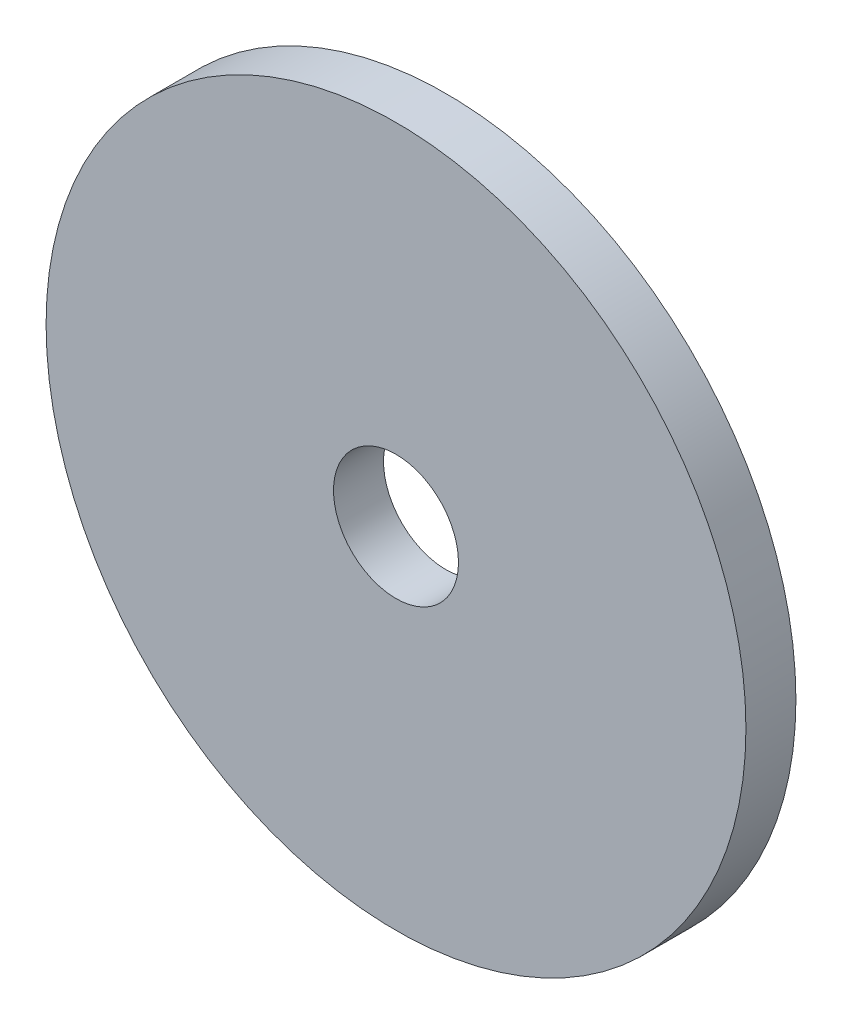
ISO-10303-21;
HEADER;
FILE_DESCRIPTION(('STEP AP214'),'2;1');
FILE_NAME('part.step','',(''),(''),'','','');
FILE_SCHEMA(('AUTOMOTIVE_DESIGN { 1 0 10303 214 1 1 1 1 }'));
ENDSEC;
DATA;
#1=APPLICATION_CONTEXT('core data for automotive mechanical design processes');
#2=APPLICATION_PROTOCOL_DEFINITION('international standard','automotive_design',2000,#1);
#3=PRODUCT_CONTEXT('',#1,'mechanical');
#4=PRODUCT('Part','Part','',(#3));
#5=PRODUCT_RELATED_PRODUCT_CATEGORY('part','',(#4));
#6=PRODUCT_DEFINITION_FORMATION('','',#4);
#7=PRODUCT_DEFINITION_CONTEXT('part definition',#1,'design');
#8=PRODUCT_DEFINITION('design','',#6,#7);
#9=PRODUCT_DEFINITION_SHAPE('','',#8);
#10=(LENGTH_UNIT() NAMED_UNIT(*) SI_UNIT(.MILLI.,.METRE.));
#11=(NAMED_UNIT(*) PLANE_ANGLE_UNIT() SI_UNIT($,.RADIAN.));
#12=(NAMED_UNIT(*) SI_UNIT($,.STERADIAN.) SOLID_ANGLE_UNIT());
#13=UNCERTAINTY_MEASURE_WITH_UNIT(LENGTH_MEASURE(1.E-05),#10,'distance_accuracy_value','');
#14=(GEOMETRIC_REPRESENTATION_CONTEXT(3) GLOBAL_UNCERTAINTY_ASSIGNED_CONTEXT((#13)) GLOBAL_UNIT_ASSIGNED_CONTEXT((#10,
#11,#12)) REPRESENTATION_CONTEXT('',''));
#15=CARTESIAN_POINT('',(0.,0.,0.));
#16=DIRECTION('',(0.,0.,1.));
#17=DIRECTION('',(1.,0.,0.));
#18=AXIS2_PLACEMENT_3D('',#15,#16,#17);
#19=CARTESIAN_POINT('',(0.,0.,2.));
#20=DIRECTION('',(0.,0.,1.));
#21=DIRECTION('',(1.,0.,0.));
#22=AXIS2_PLACEMENT_3D('',#19,#20,#21);
#23=PLANE('',#22);
#24=CARTESIAN_POINT('',(0.,0.,2.));
#25=DIRECTION('',(0.,0.,1.));
#26=DIRECTION('',(1.,0.,0.));
#27=AXIS2_PLACEMENT_3D('',#24,#25,#26);
#28=CIRCLE('',#27,14.);
#29=CARTESIAN_POINT('',(14.,0.,2.));
#30=VERTEX_POINT('',#29);
#31=EDGE_CURVE('E12',#30,#30,#28,.T.);
#32=ORIENTED_EDGE('',*,*,#31,.T.);
#33=EDGE_LOOP('',(#32));
#34=FACE_BOUND('',#33,.T.);
#35=CARTESIAN_POINT('',(0.,0.,2.));
#36=DIRECTION('',(0.,0.,1.));
#37=DIRECTION('',(1.,0.,0.));
#38=AXIS2_PLACEMENT_3D('',#35,#36,#37);
#39=CIRCLE('',#38,2.5);
#40=CARTESIAN_POINT('',(2.5,0.,2.));
#41=VERTEX_POINT('',#40);
#42=EDGE_CURVE('E55',#41,#41,#39,.T.);
#43=ORIENTED_EDGE('',*,*,#42,.F.);
#44=EDGE_LOOP('',(#43));
#45=FACE_BOUND('',#44,.T.);
#46=ADVANCED_FACE('F44',(#34,#45),#23,.T.);
#47=CARTESIAN_POINT('',(0.,0.,0.));
#48=DIRECTION('',(0.,0.,1.));
#49=DIRECTION('',(1.,0.,0.));
#50=AXIS2_PLACEMENT_3D('',#47,#48,#49);
#51=PLANE('',#50);
#52=CARTESIAN_POINT('',(0.,0.,0.));
#53=DIRECTION('',(0.,0.,1.));
#54=DIRECTION('',(1.,0.,0.));
#55=AXIS2_PLACEMENT_3D('',#52,#53,#54);
#56=CIRCLE('',#55,14.);
#57=CARTESIAN_POINT('',(14.,0.,0.));
#58=VERTEX_POINT('',#57);
#59=EDGE_CURVE('E48',#58,#58,#56,.T.);
#60=ORIENTED_EDGE('',*,*,#59,.F.);
#61=EDGE_LOOP('',(#60));
#62=FACE_BOUND('',#61,.T.);
#63=CARTESIAN_POINT('',(0.,0.,0.));
#64=DIRECTION('',(0.,0.,1.));
#65=DIRECTION('',(1.,0.,0.));
#66=AXIS2_PLACEMENT_3D('',#63,#64,#65);
#67=CIRCLE('',#66,2.5);
#68=CARTESIAN_POINT('',(2.5,0.,0.));
#69=VERTEX_POINT('',#68);
#70=EDGE_CURVE('E57',#69,#69,#67,.T.);
#71=ORIENTED_EDGE('',*,*,#70,.T.);
#72=EDGE_LOOP('',(#71));
#73=FACE_BOUND('',#72,.T.);
#74=ADVANCED_FACE('F67',(#62,#73),#51,.F.);
#75=CARTESIAN_POINT('',(0.,0.,2.));
#76=DIRECTION('',(0.,0.,-1.));
#77=DIRECTION('',(-1.,0.,0.));
#78=AXIS2_PLACEMENT_3D('',#75,#76,#77);
#79=CYLINDRICAL_SURFACE('',#78,14.);
#80=ORIENTED_EDGE('',*,*,#31,.F.);
#81=EDGE_LOOP('',(#80));
#82=FACE_BOUND('',#81,.T.);
#83=ORIENTED_EDGE('',*,*,#59,.T.);
#84=EDGE_LOOP('',(#83));
#85=FACE_BOUND('',#84,.T.);
#86=ADVANCED_FACE('F46',(#82,#85),#79,.T.);
#87=CARTESIAN_POINT('',(0.,0.,2.));
#88=DIRECTION('',(0.,0.,-1.));
#89=DIRECTION('',(-1.,0.,0.));
#90=AXIS2_PLACEMENT_3D('',#87,#88,#89);
#91=CYLINDRICAL_SURFACE('',#90,2.5);
#92=ORIENTED_EDGE('',*,*,#42,.T.);
#93=EDGE_LOOP('',(#92));
#94=FACE_BOUND('',#93,.T.);
#95=ORIENTED_EDGE('',*,*,#70,.F.);
#96=EDGE_LOOP('',(#95));
#97=FACE_BOUND('',#96,.T.);
#98=ADVANCED_FACE('F63',(#94,#97),#91,.F.);
#99=CLOSED_SHELL('',(#46,#74,#86,#98));
#100=MANIFOLD_SOLID_BREP('B2',#99);
#101=ADVANCED_BREP_SHAPE_REPRESENTATION('',(#18,#100),#14);
#102=SHAPE_DEFINITION_REPRESENTATION(#9,#101);
ENDSEC;
END-ISO-10303-21;
